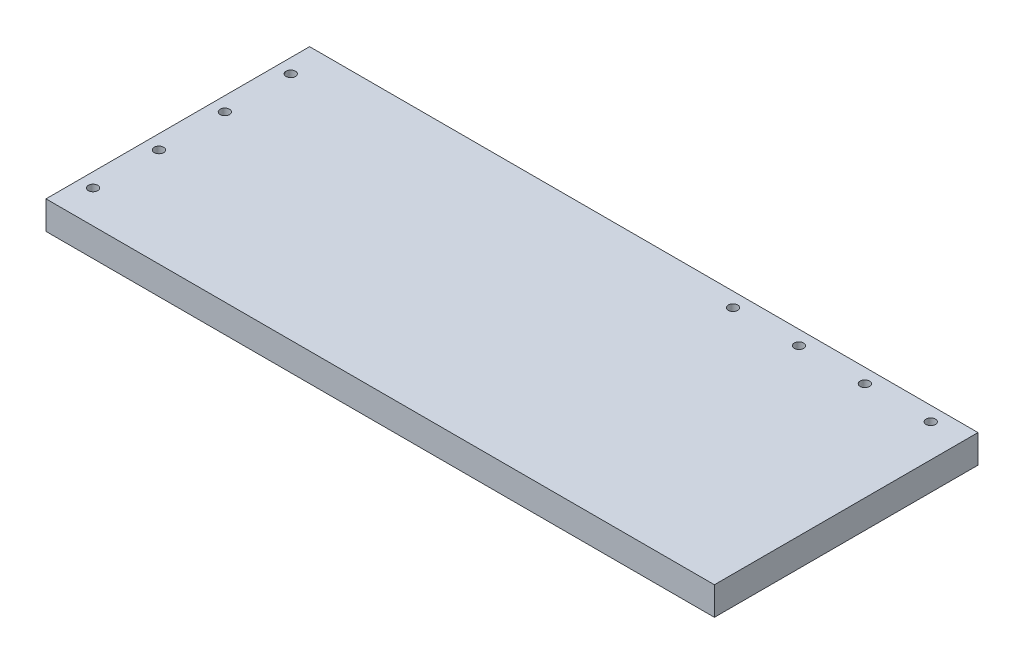
ISO-10303-21;
HEADER;
FILE_DESCRIPTION(('STEP AP214'),'2;1');
FILE_NAME('part.step','',(''),(''),'','','');
FILE_SCHEMA(('AUTOMOTIVE_DESIGN { 1 0 10303 214 1 1 1 1 }'));
ENDSEC;
DATA;
#1=APPLICATION_CONTEXT('core data for automotive mechanical design processes');
#2=APPLICATION_PROTOCOL_DEFINITION('international standard','automotive_design',2000,#1);
#3=PRODUCT_CONTEXT('',#1,'mechanical');
#4=PRODUCT('Part','Part','',(#3));
#5=PRODUCT_RELATED_PRODUCT_CATEGORY('part','',(#4));
#6=PRODUCT_DEFINITION_FORMATION('','',#4);
#7=PRODUCT_DEFINITION_CONTEXT('part definition',#1,'design');
#8=PRODUCT_DEFINITION('design','',#6,#7);
#9=PRODUCT_DEFINITION_SHAPE('','',#8);
#10=(LENGTH_UNIT() NAMED_UNIT(*) SI_UNIT(.MILLI.,.METRE.));
#11=(NAMED_UNIT(*) PLANE_ANGLE_UNIT() SI_UNIT($,.RADIAN.));
#12=(NAMED_UNIT(*) SI_UNIT($,.STERADIAN.) SOLID_ANGLE_UNIT());
#13=UNCERTAINTY_MEASURE_WITH_UNIT(LENGTH_MEASURE(1.E-05),#10,'distance_accuracy_value','');
#14=(GEOMETRIC_REPRESENTATION_CONTEXT(3) GLOBAL_UNCERTAINTY_ASSIGNED_CONTEXT((#13)) GLOBAL_UNIT_ASSIGNED_CONTEXT((#10,
#11,#12)) REPRESENTATION_CONTEXT('',''));
#15=CARTESIAN_POINT('',(0.,0.,0.));
#16=DIRECTION('',(0.,0.,1.));
#17=DIRECTION('',(1.,0.,0.));
#18=AXIS2_PLACEMENT_3D('',#15,#16,#17);
#19=CARTESIAN_POINT('',(225.425,9.525,-88.9));
#20=DIRECTION('',(-1.,0.,0.));
#21=DIRECTION('',(0.,0.,1.));
#22=AXIS2_PLACEMENT_3D('',#19,#20,#21);
#23=PLANE('',#22);
#24=DIRECTION('',(0.,0.,-1.));
#25=VECTOR('',#24,1.);
#26=CARTESIAN_POINT('',(225.425,-9.525,-88.9));
#27=LINE('',#26,#25);
#28=CARTESIAN_POINT('',(225.425,-9.525,88.9));
#29=VERTEX_POINT('',#28);
#30=CARTESIAN_POINT('',(225.425,-9.525,-88.9));
#31=VERTEX_POINT('',#30);
#32=EDGE_CURVE('E100',#29,#31,#27,.T.);
#33=ORIENTED_EDGE('',*,*,#32,.T.);
#34=DIRECTION('',(0.,-1.,0.));
#35=VECTOR('',#34,1.);
#36=CARTESIAN_POINT('',(225.425,9.525,-88.9));
#37=LINE('',#36,#35);
#38=CARTESIAN_POINT('',(225.425,9.525,-88.9));
#39=VERTEX_POINT('',#38);
#40=EDGE_CURVE('E11',#39,#31,#37,.T.);
#41=ORIENTED_EDGE('',*,*,#40,.F.);
#42=DIRECTION('',(0.,0.,-1.));
#43=VECTOR('',#42,1.);
#44=CARTESIAN_POINT('',(225.425,9.525,-88.9));
#45=LINE('',#44,#43);
#46=CARTESIAN_POINT('',(225.425,9.525,88.9));
#47=VERTEX_POINT('',#46);
#48=EDGE_CURVE('E87',#47,#39,#45,.T.);
#49=ORIENTED_EDGE('',*,*,#48,.F.);
#50=DIRECTION('',(0.,-1.,0.));
#51=VECTOR('',#50,1.);
#52=CARTESIAN_POINT('',(225.425,9.525,88.9));
#53=LINE('',#52,#51);
#54=EDGE_CURVE('E96',#47,#29,#53,.T.);
#55=ORIENTED_EDGE('',*,*,#54,.T.);
#56=EDGE_LOOP('',(#33,#41,#49,#55));
#57=FACE_BOUND('',#56,.T.);
#58=ADVANCED_FACE('F34',(#57),#23,.F.);
#59=CARTESIAN_POINT('',(-225.425,9.525,-88.9));
#60=DIRECTION('',(0.,0.,1.));
#61=DIRECTION('',(1.,0.,0.));
#62=AXIS2_PLACEMENT_3D('',#59,#60,#61);
#63=PLANE('',#62);
#64=DIRECTION('',(-1.,0.,0.));
#65=VECTOR('',#64,1.);
#66=CARTESIAN_POINT('',(-225.425,-9.525,-88.9));
#67=LINE('',#66,#65);
#68=CARTESIAN_POINT('',(-225.425,-9.525,-88.9));
#69=VERTEX_POINT('',#68);
#70=EDGE_CURVE('E91',#31,#69,#67,.T.);
#71=ORIENTED_EDGE('',*,*,#70,.T.);
#72=DIRECTION('',(0.,-1.,0.));
#73=VECTOR('',#72,1.);
#74=CARTESIAN_POINT('',(-225.425,9.525,-88.9));
#75=LINE('',#74,#73);
#76=CARTESIAN_POINT('',(-225.425,9.525,-88.9));
#77=VERTEX_POINT('',#76);
#78=EDGE_CURVE('E43',#77,#69,#75,.T.);
#79=ORIENTED_EDGE('',*,*,#78,.F.);
#80=DIRECTION('',(-1.,0.,0.));
#81=VECTOR('',#80,1.);
#82=CARTESIAN_POINT('',(-225.425,9.525,-88.9));
#83=LINE('',#82,#81);
#84=EDGE_CURVE('E82',#39,#77,#83,.T.);
#85=ORIENTED_EDGE('',*,*,#84,.F.);
#86=ORIENTED_EDGE('',*,*,#40,.T.);
#87=EDGE_LOOP('',(#71,#79,#85,#86));
#88=FACE_BOUND('',#87,.T.);
#89=ADVANCED_FACE('F90',(#88),#63,.F.);
#90=CARTESIAN_POINT('',(-225.425,9.525,-88.9));
#91=DIRECTION('',(1.,0.,0.));
#92=DIRECTION('',(0.,0.,-1.));
#93=AXIS2_PLACEMENT_3D('',#90,#91,#92);
#94=PLANE('',#93);
#95=DIRECTION('',(0.,0.,1.));
#96=VECTOR('',#95,1.);
#97=CARTESIAN_POINT('',(-225.425,-9.525,-88.9));
#98=LINE('',#97,#96);
#99=CARTESIAN_POINT('',(-225.425,-9.525,88.8999999999999));
#100=VERTEX_POINT('',#99);
#101=EDGE_CURVE('E69',#69,#100,#98,.T.);
#102=ORIENTED_EDGE('',*,*,#101,.T.);
#103=DIRECTION('',(0.,-1.,0.));
#104=VECTOR('',#103,1.);
#105=CARTESIAN_POINT('',(-225.425,9.525,88.8999999999999));
#106=LINE('',#105,#104);
#107=CARTESIAN_POINT('',(-225.425,9.525,88.8999999999999));
#108=VERTEX_POINT('',#107);
#109=EDGE_CURVE('E92',#108,#100,#106,.T.);
#110=ORIENTED_EDGE('',*,*,#109,.F.);
#111=DIRECTION('',(0.,0.,1.));
#112=VECTOR('',#111,1.);
#113=CARTESIAN_POINT('',(-225.425,9.525,-88.9));
#114=LINE('',#113,#112);
#115=EDGE_CURVE('E85',#77,#108,#114,.T.);
#116=ORIENTED_EDGE('',*,*,#115,.F.);
#117=ORIENTED_EDGE('',*,*,#78,.T.);
#118=EDGE_LOOP('',(#102,#110,#116,#117));
#119=FACE_BOUND('',#118,.T.);
#120=ADVANCED_FACE('F94',(#119),#94,.F.);
#121=CARTESIAN_POINT('',(-225.425,9.525,88.8999999999999));
#122=DIRECTION('',(0.,0.,-1.));
#123=DIRECTION('',(-1.,0.,0.));
#124=AXIS2_PLACEMENT_3D('',#121,#122,#123);
#125=PLANE('',#124);
#126=DIRECTION('',(1.,0.,0.));
#127=VECTOR('',#126,1.);
#128=CARTESIAN_POINT('',(-225.425,-9.525,88.8999999999999));
#129=LINE('',#128,#127);
#130=EDGE_CURVE('E75',#100,#29,#129,.T.);
#131=ORIENTED_EDGE('',*,*,#130,.T.);
#132=ORIENTED_EDGE('',*,*,#54,.F.);
#133=DIRECTION('',(1.,0.,0.));
#134=VECTOR('',#133,1.);
#135=CARTESIAN_POINT('',(-225.425,9.525,88.8999999999999));
#136=LINE('',#135,#134);
#137=EDGE_CURVE('E52',#108,#47,#136,.T.);
#138=ORIENTED_EDGE('',*,*,#137,.F.);
#139=ORIENTED_EDGE('',*,*,#109,.T.);
#140=EDGE_LOOP('',(#131,#132,#138,#139));
#141=FACE_BOUND('',#140,.T.);
#142=ADVANCED_FACE('F181',(#141),#125,.F.);
#143=CARTESIAN_POINT('',(0.,9.525,0.));
#144=DIRECTION('',(0.,1.,0.));
#145=DIRECTION('',(0.,0.,1.));
#146=AXIS2_PLACEMENT_3D('',#143,#144,#145);
#147=PLANE('',#146);
#148=CARTESIAN_POINT('',(203.2,9.525,-79.248));
#149=DIRECTION('',(0.,1.,0.));
#150=DIRECTION('',(0.,0.,1.));
#151=AXIS2_PLACEMENT_3D('',#148,#149,#150);
#152=CIRCLE('',#151,3.17499999999998);
#153=CARTESIAN_POINT('',(203.2,9.525,-76.073));
#154=VERTEX_POINT('',#153);
#155=EDGE_CURVE('E133',#154,#154,#152,.T.);
#156=ORIENTED_EDGE('',*,*,#155,.F.);
#157=EDGE_LOOP('',(#156));
#158=FACE_BOUND('',#157,.T.);
#159=CARTESIAN_POINT('',(158.75,9.525,-79.248));
#160=DIRECTION('',(0.,1.,0.));
#161=DIRECTION('',(0.,0.,1.));
#162=AXIS2_PLACEMENT_3D('',#159,#160,#161);
#163=CIRCLE('',#162,3.17499999999998);
#164=CARTESIAN_POINT('',(158.75,9.525,-76.073));
#165=VERTEX_POINT('',#164);
#166=EDGE_CURVE('E123',#165,#165,#163,.T.);
#167=ORIENTED_EDGE('',*,*,#166,.F.);
#168=EDGE_LOOP('',(#167));
#169=FACE_BOUND('',#168,.T.);
#170=CARTESIAN_POINT('',(114.3,9.525,-79.248));
#171=DIRECTION('',(0.,1.,0.));
#172=DIRECTION('',(0.,0.,1.));
#173=AXIS2_PLACEMENT_3D('',#170,#171,#172);
#174=CIRCLE('',#173,3.17499999999998);
#175=CARTESIAN_POINT('',(114.3,9.525,-76.073));
#176=VERTEX_POINT('',#175);
#177=EDGE_CURVE('E120',#176,#176,#174,.T.);
#178=ORIENTED_EDGE('',*,*,#177,.F.);
#179=EDGE_LOOP('',(#178));
#180=FACE_BOUND('',#179,.T.);
#181=CARTESIAN_POINT('',(69.85,9.525,-79.248));
#182=DIRECTION('',(0.,1.,0.));
#183=DIRECTION('',(0.,0.,1.));
#184=AXIS2_PLACEMENT_3D('',#181,#182,#183);
#185=CIRCLE('',#184,3.17499999999998);
#186=CARTESIAN_POINT('',(69.85,9.525,-76.073));
#187=VERTEX_POINT('',#186);
#188=EDGE_CURVE('E117',#187,#187,#185,.T.);
#189=ORIENTED_EDGE('',*,*,#188,.F.);
#190=EDGE_LOOP('',(#189));
#191=FACE_BOUND('',#190,.T.);
#192=CARTESIAN_POINT('',(-215.9,9.525,-66.675));
#193=DIRECTION('',(0.,1.,0.));
#194=DIRECTION('',(0.,0.,1.));
#195=AXIS2_PLACEMENT_3D('',#192,#193,#194);
#196=CIRCLE('',#195,3.17499999999998);
#197=CARTESIAN_POINT('',(-215.9,9.525,-63.5));
#198=VERTEX_POINT('',#197);
#199=EDGE_CURVE('E113',#198,#198,#196,.T.);
#200=ORIENTED_EDGE('',*,*,#199,.F.);
#201=EDGE_LOOP('',(#200));
#202=FACE_BOUND('',#201,.T.);
#203=CARTESIAN_POINT('',(-215.9,9.525,-22.225));
#204=DIRECTION('',(0.,1.,0.));
#205=DIRECTION('',(0.,0.,1.));
#206=AXIS2_PLACEMENT_3D('',#203,#204,#205);
#207=CIRCLE('',#206,3.17499999999998);
#208=CARTESIAN_POINT('',(-215.9,9.525,-19.05));
#209=VERTEX_POINT('',#208);
#210=EDGE_CURVE('E112',#209,#209,#207,.T.);
#211=ORIENTED_EDGE('',*,*,#210,.F.);
#212=EDGE_LOOP('',(#211));
#213=FACE_BOUND('',#212,.T.);
#214=CARTESIAN_POINT('',(-215.9,9.525,22.225));
#215=DIRECTION('',(0.,1.,0.));
#216=DIRECTION('',(0.,0.,1.));
#217=AXIS2_PLACEMENT_3D('',#214,#215,#216);
#218=CIRCLE('',#217,3.17499999999998);
#219=CARTESIAN_POINT('',(-215.9,9.525,25.4));
#220=VERTEX_POINT('',#219);
#221=EDGE_CURVE('E145',#220,#220,#218,.T.);
#222=ORIENTED_EDGE('',*,*,#221,.F.);
#223=EDGE_LOOP('',(#222));
#224=FACE_BOUND('',#223,.T.);
#225=CARTESIAN_POINT('',(-215.9,9.525,66.675));
#226=DIRECTION('',(0.,1.,0.));
#227=DIRECTION('',(0.,0.,1.));
#228=AXIS2_PLACEMENT_3D('',#225,#226,#227);
#229=CIRCLE('',#228,3.17499999999998);
#230=CARTESIAN_POINT('',(-215.9,9.525,69.85));
#231=VERTEX_POINT('',#230);
#232=EDGE_CURVE('E151',#231,#231,#229,.T.);
#233=ORIENTED_EDGE('',*,*,#232,.F.);
#234=EDGE_LOOP('',(#233));
#235=FACE_BOUND('',#234,.T.);
#236=ORIENTED_EDGE('',*,*,#48,.T.);
#237=ORIENTED_EDGE('',*,*,#84,.T.);
#238=ORIENTED_EDGE('',*,*,#115,.T.);
#239=ORIENTED_EDGE('',*,*,#137,.T.);
#240=EDGE_LOOP('',(#236,#237,#238,#239));
#241=FACE_BOUND('',#240,.T.);
#242=ADVANCED_FACE('F83',(#158,#169,#180,#191,#202,#213,#224,#235,#241),#147,.T.);
#243=CARTESIAN_POINT('',(0.,-9.525,0.));
#244=DIRECTION('',(0.,1.,0.));
#245=DIRECTION('',(0.,0.,1.));
#246=AXIS2_PLACEMENT_3D('',#243,#244,#245);
#247=PLANE('',#246);
#248=CARTESIAN_POINT('',(203.2,-9.525,-79.248));
#249=DIRECTION('',(0.,1.,0.));
#250=DIRECTION('',(0.,0.,1.));
#251=AXIS2_PLACEMENT_3D('',#248,#249,#250);
#252=CIRCLE('',#251,3.17499999999998);
#253=CARTESIAN_POINT('',(203.2,-9.525,-76.073));
#254=VERTEX_POINT('',#253);
#255=EDGE_CURVE('E37',#254,#254,#252,.T.);
#256=ORIENTED_EDGE('',*,*,#255,.T.);
#257=EDGE_LOOP('',(#256));
#258=FACE_BOUND('',#257,.T.);
#259=CARTESIAN_POINT('',(158.75,-9.525,-79.248));
#260=DIRECTION('',(0.,1.,0.));
#261=DIRECTION('',(0.,0.,1.));
#262=AXIS2_PLACEMENT_3D('',#259,#260,#261);
#263=CIRCLE('',#262,3.17499999999998);
#264=CARTESIAN_POINT('',(158.75,-9.525,-76.073));
#265=VERTEX_POINT('',#264);
#266=EDGE_CURVE('E121',#265,#265,#263,.T.);
#267=ORIENTED_EDGE('',*,*,#266,.T.);
#268=EDGE_LOOP('',(#267));
#269=FACE_BOUND('',#268,.T.);
#270=CARTESIAN_POINT('',(114.3,-9.525,-79.248));
#271=DIRECTION('',(0.,1.,0.));
#272=DIRECTION('',(0.,0.,1.));
#273=AXIS2_PLACEMENT_3D('',#270,#271,#272);
#274=CIRCLE('',#273,3.17499999999998);
#275=CARTESIAN_POINT('',(114.3,-9.525,-76.073));
#276=VERTEX_POINT('',#275);
#277=EDGE_CURVE('E118',#276,#276,#274,.T.);
#278=ORIENTED_EDGE('',*,*,#277,.T.);
#279=EDGE_LOOP('',(#278));
#280=FACE_BOUND('',#279,.T.);
#281=CARTESIAN_POINT('',(69.85,-9.525,-79.248));
#282=DIRECTION('',(0.,1.,0.));
#283=DIRECTION('',(0.,0.,1.));
#284=AXIS2_PLACEMENT_3D('',#281,#282,#283);
#285=CIRCLE('',#284,3.17499999999998);
#286=CARTESIAN_POINT('',(69.85,-9.525,-76.073));
#287=VERTEX_POINT('',#286);
#288=EDGE_CURVE('E114',#287,#287,#285,.T.);
#289=ORIENTED_EDGE('',*,*,#288,.T.);
#290=EDGE_LOOP('',(#289));
#291=FACE_BOUND('',#290,.T.);
#292=CARTESIAN_POINT('',(-215.9,-9.525,-66.675));
#293=DIRECTION('',(0.,1.,0.));
#294=DIRECTION('',(0.,0.,1.));
#295=AXIS2_PLACEMENT_3D('',#292,#293,#294);
#296=CIRCLE('',#295,3.17499999999998);
#297=CARTESIAN_POINT('',(-215.9,-9.525,-63.5));
#298=VERTEX_POINT('',#297);
#299=EDGE_CURVE('E109',#298,#298,#296,.T.);
#300=ORIENTED_EDGE('',*,*,#299,.T.);
#301=EDGE_LOOP('',(#300));
#302=FACE_BOUND('',#301,.T.);
#303=CARTESIAN_POINT('',(-215.9,-9.525,-22.225));
#304=DIRECTION('',(0.,1.,0.));
#305=DIRECTION('',(0.,0.,1.));
#306=AXIS2_PLACEMENT_3D('',#303,#304,#305);
#307=CIRCLE('',#306,3.17499999999998);
#308=CARTESIAN_POINT('',(-215.9,-9.525,-19.05));
#309=VERTEX_POINT('',#308);
#310=EDGE_CURVE('E142',#309,#309,#307,.T.);
#311=ORIENTED_EDGE('',*,*,#310,.T.);
#312=EDGE_LOOP('',(#311));
#313=FACE_BOUND('',#312,.T.);
#314=CARTESIAN_POINT('',(-215.9,-9.525,22.225));
#315=DIRECTION('',(0.,1.,0.));
#316=DIRECTION('',(0.,0.,1.));
#317=AXIS2_PLACEMENT_3D('',#314,#315,#316);
#318=CIRCLE('',#317,3.17499999999998);
#319=CARTESIAN_POINT('',(-215.9,-9.525,25.4));
#320=VERTEX_POINT('',#319);
#321=EDGE_CURVE('E148',#320,#320,#318,.T.);
#322=ORIENTED_EDGE('',*,*,#321,.T.);
#323=EDGE_LOOP('',(#322));
#324=FACE_BOUND('',#323,.T.);
#325=CARTESIAN_POINT('',(-215.9,-9.525,66.675));
#326=DIRECTION('',(0.,1.,0.));
#327=DIRECTION('',(0.,0.,1.));
#328=AXIS2_PLACEMENT_3D('',#325,#326,#327);
#329=CIRCLE('',#328,3.17499999999998);
#330=CARTESIAN_POINT('',(-215.9,-9.525,69.85));
#331=VERTEX_POINT('',#330);
#332=EDGE_CURVE('E103',#331,#331,#329,.T.);
#333=ORIENTED_EDGE('',*,*,#332,.T.);
#334=EDGE_LOOP('',(#333));
#335=FACE_BOUND('',#334,.T.);
#336=ORIENTED_EDGE('',*,*,#32,.F.);
#337=ORIENTED_EDGE('',*,*,#130,.F.);
#338=ORIENTED_EDGE('',*,*,#101,.F.);
#339=ORIENTED_EDGE('',*,*,#70,.F.);
#340=EDGE_LOOP('',(#336,#337,#338,#339));
#341=FACE_BOUND('',#340,.T.);
#342=ADVANCED_FACE('F157',(#258,#269,#280,#291,#302,#313,#324,#335,#341),#247,.F.);
#343=CARTESIAN_POINT('',(-215.9,9.525,66.675));
#344=DIRECTION('',(0.,1.,0.));
#345=DIRECTION('',(0.,0.,1.));
#346=AXIS2_PLACEMENT_3D('',#343,#344,#345);
#347=CYLINDRICAL_SURFACE('',#346,3.17499999999998);
#348=ORIENTED_EDGE('',*,*,#232,.T.);
#349=EDGE_LOOP('',(#348));
#350=FACE_BOUND('',#349,.T.);
#351=ORIENTED_EDGE('',*,*,#332,.F.);
#352=EDGE_LOOP('',(#351));
#353=FACE_BOUND('',#352,.T.);
#354=ADVANCED_FACE('F160',(#350,#353),#347,.F.);
#355=CARTESIAN_POINT('',(-215.9,9.525,22.225));
#356=DIRECTION('',(0.,1.,0.));
#357=DIRECTION('',(0.,0.,1.));
#358=AXIS2_PLACEMENT_3D('',#355,#356,#357);
#359=CYLINDRICAL_SURFACE('',#358,3.17499999999998);
#360=ORIENTED_EDGE('',*,*,#221,.T.);
#361=EDGE_LOOP('',(#360));
#362=FACE_BOUND('',#361,.T.);
#363=ORIENTED_EDGE('',*,*,#321,.F.);
#364=EDGE_LOOP('',(#363));
#365=FACE_BOUND('',#364,.T.);
#366=ADVANCED_FACE('F162',(#362,#365),#359,.F.);
#367=CARTESIAN_POINT('',(-215.9,9.525,-22.225));
#368=DIRECTION('',(0.,1.,0.));
#369=DIRECTION('',(0.,0.,1.));
#370=AXIS2_PLACEMENT_3D('',#367,#368,#369);
#371=CYLINDRICAL_SURFACE('',#370,3.17499999999998);
#372=ORIENTED_EDGE('',*,*,#210,.T.);
#373=EDGE_LOOP('',(#372));
#374=FACE_BOUND('',#373,.T.);
#375=ORIENTED_EDGE('',*,*,#310,.F.);
#376=EDGE_LOOP('',(#375));
#377=FACE_BOUND('',#376,.T.);
#378=ADVANCED_FACE('F169',(#374,#377),#371,.F.);
#379=CARTESIAN_POINT('',(-215.9,9.525,-66.675));
#380=DIRECTION('',(0.,1.,0.));
#381=DIRECTION('',(0.,0.,1.));
#382=AXIS2_PLACEMENT_3D('',#379,#380,#381);
#383=CYLINDRICAL_SURFACE('',#382,3.17499999999998);
#384=ORIENTED_EDGE('',*,*,#199,.T.);
#385=EDGE_LOOP('',(#384));
#386=FACE_BOUND('',#385,.T.);
#387=ORIENTED_EDGE('',*,*,#299,.F.);
#388=EDGE_LOOP('',(#387));
#389=FACE_BOUND('',#388,.T.);
#390=ADVANCED_FACE('F237',(#386,#389),#383,.F.);
#391=CARTESIAN_POINT('',(69.85,9.525,-79.248));
#392=DIRECTION('',(0.,1.,0.));
#393=DIRECTION('',(0.,0.,1.));
#394=AXIS2_PLACEMENT_3D('',#391,#392,#393);
#395=CYLINDRICAL_SURFACE('',#394,3.17499999999998);
#396=ORIENTED_EDGE('',*,*,#188,.T.);
#397=EDGE_LOOP('',(#396));
#398=FACE_BOUND('',#397,.T.);
#399=ORIENTED_EDGE('',*,*,#288,.F.);
#400=EDGE_LOOP('',(#399));
#401=FACE_BOUND('',#400,.T.);
#402=ADVANCED_FACE('F245',(#398,#401),#395,.F.);
#403=CARTESIAN_POINT('',(114.3,9.525,-79.248));
#404=DIRECTION('',(0.,1.,0.));
#405=DIRECTION('',(0.,0.,1.));
#406=AXIS2_PLACEMENT_3D('',#403,#404,#405);
#407=CYLINDRICAL_SURFACE('',#406,3.17499999999998);
#408=ORIENTED_EDGE('',*,*,#177,.T.);
#409=EDGE_LOOP('',(#408));
#410=FACE_BOUND('',#409,.T.);
#411=ORIENTED_EDGE('',*,*,#277,.F.);
#412=EDGE_LOOP('',(#411));
#413=FACE_BOUND('',#412,.T.);
#414=ADVANCED_FACE('F253',(#410,#413),#407,.F.);
#415=CARTESIAN_POINT('',(158.75,9.525,-79.248));
#416=DIRECTION('',(0.,1.,0.));
#417=DIRECTION('',(0.,0.,1.));
#418=AXIS2_PLACEMENT_3D('',#415,#416,#417);
#419=CYLINDRICAL_SURFACE('',#418,3.17499999999998);
#420=ORIENTED_EDGE('',*,*,#166,.T.);
#421=EDGE_LOOP('',(#420));
#422=FACE_BOUND('',#421,.T.);
#423=ORIENTED_EDGE('',*,*,#266,.F.);
#424=EDGE_LOOP('',(#423));
#425=FACE_BOUND('',#424,.T.);
#426=ADVANCED_FACE('F262',(#422,#425),#419,.F.);
#427=CARTESIAN_POINT('',(203.2,9.525,-79.248));
#428=DIRECTION('',(0.,1.,0.));
#429=DIRECTION('',(0.,0.,1.));
#430=AXIS2_PLACEMENT_3D('',#427,#428,#429);
#431=CYLINDRICAL_SURFACE('',#430,3.17499999999998);
#432=ORIENTED_EDGE('',*,*,#155,.T.);
#433=EDGE_LOOP('',(#432));
#434=FACE_BOUND('',#433,.T.);
#435=ORIENTED_EDGE('',*,*,#255,.F.);
#436=EDGE_LOOP('',(#435));
#437=FACE_BOUND('',#436,.T.);
#438=ADVANCED_FACE('F271',(#434,#437),#431,.F.);
#439=CLOSED_SHELL('',(#58,#89,#120,#142,#242,#342,#354,#366,#378,#390,#402,#414,#426,#438));
#440=MANIFOLD_SOLID_BREP('B2',#439);
#441=ADVANCED_BREP_SHAPE_REPRESENTATION('',(#18,#440),#14);
#442=SHAPE_DEFINITION_REPRESENTATION(#9,#441);
ENDSEC;
END-ISO-10303-21;
